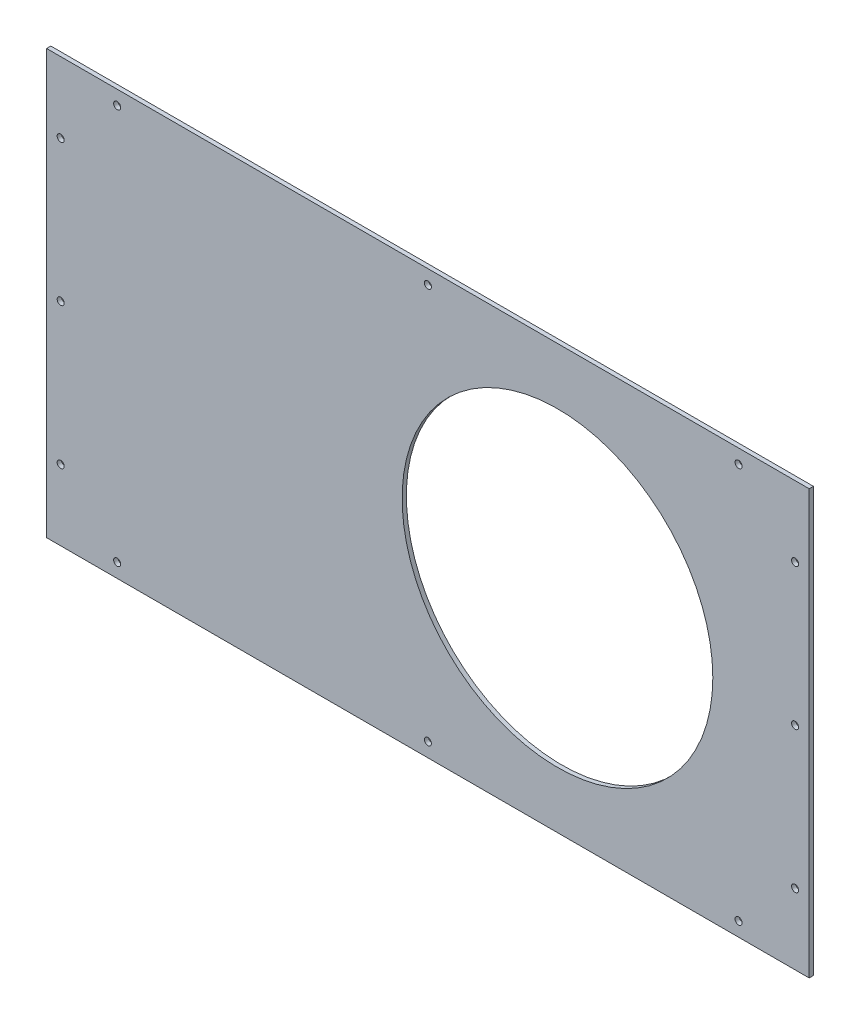
ISO-10303-21;
HEADER;
FILE_DESCRIPTION(('STEP AP214'),'2;1');
FILE_NAME('part.step','',(''),(''),'','','');
FILE_SCHEMA(('AUTOMOTIVE_DESIGN { 1 0 10303 214 1 1 1 1 }'));
ENDSEC;
DATA;
#1=APPLICATION_CONTEXT('core data for automotive mechanical design processes');
#2=APPLICATION_PROTOCOL_DEFINITION('international standard','automotive_design',2000,#1);
#3=PRODUCT_CONTEXT('',#1,'mechanical');
#4=PRODUCT('Part','Part','',(#3));
#5=PRODUCT_RELATED_PRODUCT_CATEGORY('part','',(#4));
#6=PRODUCT_DEFINITION_FORMATION('','',#4);
#7=PRODUCT_DEFINITION_CONTEXT('part definition',#1,'design');
#8=PRODUCT_DEFINITION('design','',#6,#7);
#9=PRODUCT_DEFINITION_SHAPE('','',#8);
#10=(LENGTH_UNIT() NAMED_UNIT(*) SI_UNIT(.MILLI.,.METRE.));
#11=(NAMED_UNIT(*) PLANE_ANGLE_UNIT() SI_UNIT($,.RADIAN.));
#12=(NAMED_UNIT(*) SI_UNIT($,.STERADIAN.) SOLID_ANGLE_UNIT());
#13=UNCERTAINTY_MEASURE_WITH_UNIT(LENGTH_MEASURE(1.E-05),#10,'distance_accuracy_value','');
#14=(GEOMETRIC_REPRESENTATION_CONTEXT(3) GLOBAL_UNCERTAINTY_ASSIGNED_CONTEXT((#13)) GLOBAL_UNIT_ASSIGNED_CONTEXT((#10,
#11,#12)) REPRESENTATION_CONTEXT('',''));
#15=CARTESIAN_POINT('',(0.,0.,0.));
#16=DIRECTION('',(0.,0.,1.));
#17=DIRECTION('',(1.,0.,0.));
#18=AXIS2_PLACEMENT_3D('',#15,#16,#17);
#19=CARTESIAN_POINT('',(270.,150.,3.));
#20=DIRECTION('',(-1.,0.,0.));
#21=DIRECTION('',(0.,0.,1.));
#22=AXIS2_PLACEMENT_3D('',#19,#20,#21);
#23=PLANE('',#22);
#24=DIRECTION('',(0.,1.,0.));
#25=VECTOR('',#24,1.);
#26=CARTESIAN_POINT('',(270.,150.,0.));
#27=LINE('',#26,#25);
#28=CARTESIAN_POINT('',(270.,-150.,0.));
#29=VERTEX_POINT('',#28);
#30=CARTESIAN_POINT('',(270.,150.,0.));
#31=VERTEX_POINT('',#30);
#32=EDGE_CURVE('E108',#29,#31,#27,.T.);
#33=ORIENTED_EDGE('',*,*,#32,.T.);
#34=DIRECTION('',(0.,0.,-1.));
#35=VECTOR('',#34,1.);
#36=CARTESIAN_POINT('',(270.,150.,3.));
#37=LINE('',#36,#35);
#38=CARTESIAN_POINT('',(270.,150.,3.));
#39=VERTEX_POINT('',#38);
#40=EDGE_CURVE('E11',#39,#31,#37,.T.);
#41=ORIENTED_EDGE('',*,*,#40,.F.);
#42=DIRECTION('',(0.,1.,0.));
#43=VECTOR('',#42,1.);
#44=CARTESIAN_POINT('',(270.,150.,3.));
#45=LINE('',#44,#43);
#46=CARTESIAN_POINT('',(270.,-150.,3.));
#47=VERTEX_POINT('',#46);
#48=EDGE_CURVE('E92',#47,#39,#45,.T.);
#49=ORIENTED_EDGE('',*,*,#48,.F.);
#50=DIRECTION('',(0.,0.,-1.));
#51=VECTOR('',#50,1.);
#52=CARTESIAN_POINT('',(270.,-150.,3.));
#53=LINE('',#52,#51);
#54=EDGE_CURVE('E104',#47,#29,#53,.T.);
#55=ORIENTED_EDGE('',*,*,#54,.T.);
#56=EDGE_LOOP('',(#33,#41,#49,#55));
#57=FACE_BOUND('',#56,.T.);
#58=ADVANCED_FACE('F40',(#57),#23,.F.);
#59=CARTESIAN_POINT('',(-270.,150.,3.));
#60=DIRECTION('',(0.,-1.,0.));
#61=DIRECTION('',(0.,0.,-1.));
#62=AXIS2_PLACEMENT_3D('',#59,#60,#61);
#63=PLANE('',#62);
#64=DIRECTION('',(-1.,0.,0.));
#65=VECTOR('',#64,1.);
#66=CARTESIAN_POINT('',(-270.,150.,0.));
#67=LINE('',#66,#65);
#68=CARTESIAN_POINT('',(-270.,150.,0.));
#69=VERTEX_POINT('',#68);
#70=EDGE_CURVE('E97',#31,#69,#67,.T.);
#71=ORIENTED_EDGE('',*,*,#70,.T.);
#72=DIRECTION('',(0.,0.,-1.));
#73=VECTOR('',#72,1.);
#74=CARTESIAN_POINT('',(-270.,150.,3.));
#75=LINE('',#74,#73);
#76=CARTESIAN_POINT('',(-270.,150.,3.));
#77=VERTEX_POINT('',#76);
#78=EDGE_CURVE('E49',#77,#69,#75,.T.);
#79=ORIENTED_EDGE('',*,*,#78,.F.);
#80=DIRECTION('',(-1.,0.,0.));
#81=VECTOR('',#80,1.);
#82=CARTESIAN_POINT('',(-270.,150.,3.));
#83=LINE('',#82,#81);
#84=EDGE_CURVE('E87',#39,#77,#83,.T.);
#85=ORIENTED_EDGE('',*,*,#84,.F.);
#86=ORIENTED_EDGE('',*,*,#40,.T.);
#87=EDGE_LOOP('',(#71,#79,#85,#86));
#88=FACE_BOUND('',#87,.T.);
#89=ADVANCED_FACE('F96',(#88),#63,.F.);
#90=CARTESIAN_POINT('',(-270.,150.,3.));
#91=DIRECTION('',(1.,0.,0.));
#92=DIRECTION('',(0.,1.,0.));
#93=AXIS2_PLACEMENT_3D('',#90,#91,#92);
#94=PLANE('',#93);
#95=DIRECTION('',(0.,-1.,0.));
#96=VECTOR('',#95,1.);
#97=CARTESIAN_POINT('',(-270.,150.,0.));
#98=LINE('',#97,#96);
#99=CARTESIAN_POINT('',(-270.,-150.,0.));
#100=VERTEX_POINT('',#99);
#101=EDGE_CURVE('E74',#69,#100,#98,.T.);
#102=ORIENTED_EDGE('',*,*,#101,.T.);
#103=DIRECTION('',(0.,0.,-1.));
#104=VECTOR('',#103,1.);
#105=CARTESIAN_POINT('',(-270.,-150.,3.));
#106=LINE('',#105,#104);
#107=CARTESIAN_POINT('',(-270.,-150.,3.));
#108=VERTEX_POINT('',#107);
#109=EDGE_CURVE('E99',#108,#100,#106,.T.);
#110=ORIENTED_EDGE('',*,*,#109,.F.);
#111=DIRECTION('',(0.,-1.,0.));
#112=VECTOR('',#111,1.);
#113=CARTESIAN_POINT('',(-270.,150.,3.));
#114=LINE('',#113,#112);
#115=EDGE_CURVE('E90',#77,#108,#114,.T.);
#116=ORIENTED_EDGE('',*,*,#115,.F.);
#117=ORIENTED_EDGE('',*,*,#78,.T.);
#118=EDGE_LOOP('',(#102,#110,#116,#117));
#119=FACE_BOUND('',#118,.T.);
#120=ADVANCED_FACE('F100',(#119),#94,.F.);
#121=CARTESIAN_POINT('',(-270.,-150.,3.));
#122=DIRECTION('',(0.,1.,0.));
#123=DIRECTION('',(0.,0.,1.));
#124=AXIS2_PLACEMENT_3D('',#121,#122,#123);
#125=PLANE('',#124);
#126=DIRECTION('',(1.,0.,0.));
#127=VECTOR('',#126,1.);
#128=CARTESIAN_POINT('',(-270.,-150.,0.));
#129=LINE('',#128,#127);
#130=EDGE_CURVE('E80',#100,#29,#129,.T.);
#131=ORIENTED_EDGE('',*,*,#130,.T.);
#132=ORIENTED_EDGE('',*,*,#54,.F.);
#133=DIRECTION('',(1.,0.,0.));
#134=VECTOR('',#133,1.);
#135=CARTESIAN_POINT('',(-270.,-150.,3.));
#136=LINE('',#135,#134);
#137=EDGE_CURVE('E57',#108,#47,#136,.T.);
#138=ORIENTED_EDGE('',*,*,#137,.F.);
#139=ORIENTED_EDGE('',*,*,#109,.T.);
#140=EDGE_LOOP('',(#131,#132,#138,#139));
#141=FACE_BOUND('',#140,.T.);
#142=ADVANCED_FACE('F122',(#141),#125,.F.);
#143=CARTESIAN_POINT('',(0.,0.,3.));
#144=DIRECTION('',(0.,0.,1.));
#145=DIRECTION('',(1.,0.,0.));
#146=AXIS2_PLACEMENT_3D('',#143,#144,#145);
#147=PLANE('',#146);
#148=CARTESIAN_POINT('',(91.7561908191329,0.,3.));
#149=DIRECTION('',(0.,0.,1.));
#150=DIRECTION('',(1.,0.,0.));
#151=AXIS2_PLACEMENT_3D('',#148,#149,#150);
#152=CIRCLE('',#151,110.);
#153=CARTESIAN_POINT('',(201.756190819133,0.,3.));
#154=VERTEX_POINT('',#153);
#155=EDGE_CURVE('E225',#154,#154,#152,.T.);
#156=ORIENTED_EDGE('',*,*,#155,.F.);
#157=EDGE_LOOP('',(#156));
#158=FACE_BOUND('',#157,.T.);
#159=CARTESIAN_POINT('',(-220.,-139.999999999999,3.));
#160=DIRECTION('',(0.,0.,1.));
#161=DIRECTION('',(-1.,0.,0.));
#162=AXIS2_PLACEMENT_3D('',#159,#160,#161);
#163=CIRCLE('',#162,2.5);
#164=CARTESIAN_POINT('',(-222.5,-139.999999999999,3.));
#165=VERTEX_POINT('',#164);
#166=EDGE_CURVE('E137',#165,#165,#163,.T.);
#167=ORIENTED_EDGE('',*,*,#166,.F.);
#168=EDGE_LOOP('',(#167));
#169=FACE_BOUND('',#168,.T.);
#170=CARTESIAN_POINT('',(0.,-140.,3.));
#171=DIRECTION('',(0.,0.,1.));
#172=DIRECTION('',(-1.,0.,0.));
#173=AXIS2_PLACEMENT_3D('',#170,#171,#172);
#174=CIRCLE('',#173,2.5);
#175=CARTESIAN_POINT('',(-2.5,-140.,3.));
#176=VERTEX_POINT('',#175);
#177=EDGE_CURVE('E146',#176,#176,#174,.T.);
#178=ORIENTED_EDGE('',*,*,#177,.F.);
#179=EDGE_LOOP('',(#178));
#180=FACE_BOUND('',#179,.T.);
#181=CARTESIAN_POINT('',(220.,-139.999999999999,3.));
#182=DIRECTION('',(0.,0.,1.));
#183=DIRECTION('',(1.,0.,0.));
#184=AXIS2_PLACEMENT_3D('',#181,#182,#183);
#185=CIRCLE('',#184,2.5);
#186=CARTESIAN_POINT('',(222.5,-139.999999999999,3.));
#187=VERTEX_POINT('',#186);
#188=EDGE_CURVE('E154',#187,#187,#185,.T.);
#189=ORIENTED_EDGE('',*,*,#188,.F.);
#190=EDGE_LOOP('',(#189));
#191=FACE_BOUND('',#190,.T.);
#192=CARTESIAN_POINT('',(220.,139.999999999999,3.));
#193=DIRECTION('',(0.,0.,1.));
#194=DIRECTION('',(-1.,0.,0.));
#195=AXIS2_PLACEMENT_3D('',#192,#193,#194);
#196=CIRCLE('',#195,2.5);
#197=CARTESIAN_POINT('',(217.5,139.999999999999,3.));
#198=VERTEX_POINT('',#197);
#199=EDGE_CURVE('E172',#198,#198,#196,.T.);
#200=ORIENTED_EDGE('',*,*,#199,.F.);
#201=EDGE_LOOP('',(#200));
#202=FACE_BOUND('',#201,.T.);
#203=CARTESIAN_POINT('',(260.,-100.,3.));
#204=DIRECTION('',(0.,0.,1.));
#205=DIRECTION('',(1.,0.,0.));
#206=AXIS2_PLACEMENT_3D('',#203,#204,#205);
#207=CIRCLE('',#206,2.50000000000002);
#208=CARTESIAN_POINT('',(262.5,-100.,3.));
#209=VERTEX_POINT('',#208);
#210=EDGE_CURVE('E163',#209,#209,#207,.T.);
#211=ORIENTED_EDGE('',*,*,#210,.F.);
#212=EDGE_LOOP('',(#211));
#213=FACE_BOUND('',#212,.T.);
#214=CARTESIAN_POINT('',(260.,0.,3.));
#215=DIRECTION('',(0.,0.,1.));
#216=DIRECTION('',(-1.,0.,0.));
#217=AXIS2_PLACEMENT_3D('',#214,#215,#216);
#218=CIRCLE('',#217,2.50000000000008);
#219=CARTESIAN_POINT('',(257.5,0.,3.));
#220=VERTEX_POINT('',#219);
#221=EDGE_CURVE('E188',#220,#220,#218,.T.);
#222=ORIENTED_EDGE('',*,*,#221,.F.);
#223=EDGE_LOOP('',(#222));
#224=FACE_BOUND('',#223,.T.);
#225=CARTESIAN_POINT('',(260.,100.,3.));
#226=DIRECTION('',(0.,0.,1.));
#227=DIRECTION('',(-1.,0.,0.));
#228=AXIS2_PLACEMENT_3D('',#225,#226,#227);
#229=CIRCLE('',#228,2.50000000000002);
#230=CARTESIAN_POINT('',(257.5,100.,3.));
#231=VERTEX_POINT('',#230);
#232=EDGE_CURVE('E162',#231,#231,#229,.T.);
#233=ORIENTED_EDGE('',*,*,#232,.F.);
#234=EDGE_LOOP('',(#233));
#235=FACE_BOUND('',#234,.T.);
#236=CARTESIAN_POINT('',(-260.,0.,3.));
#237=DIRECTION('',(0.,0.,1.));
#238=DIRECTION('',(1.,0.,0.));
#239=AXIS2_PLACEMENT_3D('',#236,#237,#238);
#240=CIRCLE('',#239,2.50000000000002);
#241=CARTESIAN_POINT('',(-257.5,0.,3.));
#242=VERTEX_POINT('',#241);
#243=EDGE_CURVE('E204',#242,#242,#240,.T.);
#244=ORIENTED_EDGE('',*,*,#243,.F.);
#245=EDGE_LOOP('',(#244));
#246=FACE_BOUND('',#245,.T.);
#247=CARTESIAN_POINT('',(-220.,139.999999999999,3.));
#248=DIRECTION('',(0.,0.,1.));
#249=DIRECTION('',(1.,0.,0.));
#250=AXIS2_PLACEMENT_3D('',#247,#248,#249);
#251=CIRCLE('',#250,2.5);
#252=CARTESIAN_POINT('',(-217.5,139.999999999999,3.));
#253=VERTEX_POINT('',#252);
#254=EDGE_CURVE('E195',#253,#253,#251,.T.);
#255=ORIENTED_EDGE('',*,*,#254,.F.);
#256=EDGE_LOOP('',(#255));
#257=FACE_BOUND('',#256,.T.);
#258=CARTESIAN_POINT('',(-260.,-100.,3.));
#259=DIRECTION('',(0.,0.,1.));
#260=DIRECTION('',(-1.,0.,0.));
#261=AXIS2_PLACEMENT_3D('',#258,#259,#260);
#262=CIRCLE('',#261,2.50000000000002);
#263=CARTESIAN_POINT('',(-262.5,-100.,3.));
#264=VERTEX_POINT('',#263);
#265=EDGE_CURVE('E218',#264,#264,#262,.T.);
#266=ORIENTED_EDGE('',*,*,#265,.F.);
#267=EDGE_LOOP('',(#266));
#268=FACE_BOUND('',#267,.T.);
#269=CARTESIAN_POINT('',(-260.,100.,3.));
#270=DIRECTION('',(0.,0.,1.));
#271=DIRECTION('',(1.,0.,0.));
#272=AXIS2_PLACEMENT_3D('',#269,#270,#271);
#273=CIRCLE('',#272,2.50000000000002);
#274=CARTESIAN_POINT('',(-257.5,100.,3.));
#275=VERTEX_POINT('',#274);
#276=EDGE_CURVE('E180',#275,#275,#273,.T.);
#277=ORIENTED_EDGE('',*,*,#276,.F.);
#278=EDGE_LOOP('',(#277));
#279=FACE_BOUND('',#278,.T.);
#280=CARTESIAN_POINT('',(0.,140.,3.));
#281=DIRECTION('',(0.,0.,1.));
#282=DIRECTION('',(1.,0.,0.));
#283=AXIS2_PLACEMENT_3D('',#280,#281,#282);
#284=CIRCLE('',#283,2.5);
#285=CARTESIAN_POINT('',(2.5,140.,3.));
#286=VERTEX_POINT('',#285);
#287=EDGE_CURVE('E129',#286,#286,#284,.T.);
#288=ORIENTED_EDGE('',*,*,#287,.F.);
#289=EDGE_LOOP('',(#288));
#290=FACE_BOUND('',#289,.T.);
#291=ORIENTED_EDGE('',*,*,#48,.T.);
#292=ORIENTED_EDGE('',*,*,#84,.T.);
#293=ORIENTED_EDGE('',*,*,#115,.T.);
#294=ORIENTED_EDGE('',*,*,#137,.T.);
#295=EDGE_LOOP('',(#291,#292,#293,#294));
#296=FACE_BOUND('',#295,.T.);
#297=ADVANCED_FACE('F88',(#158,#169,#180,#191,#202,#213,#224,#235,#246,#257,#268,#279,#290,
#296),#147,.T.);
#298=CARTESIAN_POINT('',(0.,0.,0.));
#299=DIRECTION('',(0.,0.,1.));
#300=DIRECTION('',(1.,0.,0.));
#301=AXIS2_PLACEMENT_3D('',#298,#299,#300);
#302=PLANE('',#301);
#303=CARTESIAN_POINT('',(91.7561908191329,0.,0.));
#304=DIRECTION('',(0.,0.,1.));
#305=DIRECTION('',(1.,0.,0.));
#306=AXIS2_PLACEMENT_3D('',#303,#304,#305);
#307=CIRCLE('',#306,110.);
#308=CARTESIAN_POINT('',(201.756190819133,0.,0.));
#309=VERTEX_POINT('',#308);
#310=EDGE_CURVE('E142',#309,#309,#307,.T.);
#311=ORIENTED_EDGE('',*,*,#310,.T.);
#312=EDGE_LOOP('',(#311));
#313=FACE_BOUND('',#312,.T.);
#314=CARTESIAN_POINT('',(-220.,-139.999999999999,0.));
#315=DIRECTION('',(0.,0.,1.));
#316=DIRECTION('',(-1.,0.,0.));
#317=AXIS2_PLACEMENT_3D('',#314,#315,#316);
#318=CIRCLE('',#317,2.5);
#319=CARTESIAN_POINT('',(-222.5,-139.999999999999,0.));
#320=VERTEX_POINT('',#319);
#321=EDGE_CURVE('E141',#320,#320,#318,.T.);
#322=ORIENTED_EDGE('',*,*,#321,.T.);
#323=EDGE_LOOP('',(#322));
#324=FACE_BOUND('',#323,.T.);
#325=CARTESIAN_POINT('',(0.,-140.,0.));
#326=DIRECTION('',(0.,0.,1.));
#327=DIRECTION('',(-1.,0.,0.));
#328=AXIS2_PLACEMENT_3D('',#325,#326,#327);
#329=CIRCLE('',#328,2.5);
#330=CARTESIAN_POINT('',(-2.5,-140.,0.));
#331=VERTEX_POINT('',#330);
#332=EDGE_CURVE('E150',#331,#331,#329,.T.);
#333=ORIENTED_EDGE('',*,*,#332,.T.);
#334=EDGE_LOOP('',(#333));
#335=FACE_BOUND('',#334,.T.);
#336=CARTESIAN_POINT('',(220.,-139.999999999999,0.));
#337=DIRECTION('',(0.,0.,1.));
#338=DIRECTION('',(1.,0.,0.));
#339=AXIS2_PLACEMENT_3D('',#336,#337,#338);
#340=CIRCLE('',#339,2.5);
#341=CARTESIAN_POINT('',(222.5,-139.999999999999,0.));
#342=VERTEX_POINT('',#341);
#343=EDGE_CURVE('E158',#342,#342,#340,.T.);
#344=ORIENTED_EDGE('',*,*,#343,.T.);
#345=EDGE_LOOP('',(#344));
#346=FACE_BOUND('',#345,.T.);
#347=CARTESIAN_POINT('',(220.,139.999999999999,0.));
#348=DIRECTION('',(0.,0.,1.));
#349=DIRECTION('',(-1.,0.,0.));
#350=AXIS2_PLACEMENT_3D('',#347,#348,#349);
#351=CIRCLE('',#350,2.5);
#352=CARTESIAN_POINT('',(217.5,139.999999999999,0.));
#353=VERTEX_POINT('',#352);
#354=EDGE_CURVE('E176',#353,#353,#351,.T.);
#355=ORIENTED_EDGE('',*,*,#354,.T.);
#356=EDGE_LOOP('',(#355));
#357=FACE_BOUND('',#356,.T.);
#358=CARTESIAN_POINT('',(260.,-100.,0.));
#359=DIRECTION('',(0.,0.,1.));
#360=DIRECTION('',(1.,0.,0.));
#361=AXIS2_PLACEMENT_3D('',#358,#359,#360);
#362=CIRCLE('',#361,2.50000000000002);
#363=CARTESIAN_POINT('',(262.5,-100.,0.));
#364=VERTEX_POINT('',#363);
#365=EDGE_CURVE('E167',#364,#364,#362,.T.);
#366=ORIENTED_EDGE('',*,*,#365,.T.);
#367=EDGE_LOOP('',(#366));
#368=FACE_BOUND('',#367,.T.);
#369=CARTESIAN_POINT('',(260.,0.,0.));
#370=DIRECTION('',(0.,0.,1.));
#371=DIRECTION('',(-1.,0.,0.));
#372=AXIS2_PLACEMENT_3D('',#369,#370,#371);
#373=CIRCLE('',#372,2.50000000000008);
#374=CARTESIAN_POINT('',(257.5,0.,0.));
#375=VERTEX_POINT('',#374);
#376=EDGE_CURVE('E168',#375,#375,#373,.T.);
#377=ORIENTED_EDGE('',*,*,#376,.T.);
#378=EDGE_LOOP('',(#377));
#379=FACE_BOUND('',#378,.T.);
#380=CARTESIAN_POINT('',(260.,100.,0.));
#381=DIRECTION('',(0.,0.,1.));
#382=DIRECTION('',(-1.,0.,0.));
#383=AXIS2_PLACEMENT_3D('',#380,#381,#382);
#384=CIRCLE('',#383,2.50000000000002);
#385=CARTESIAN_POINT('',(257.5,100.,0.));
#386=VERTEX_POINT('',#385);
#387=EDGE_CURVE('E184',#386,#386,#384,.T.);
#388=ORIENTED_EDGE('',*,*,#387,.T.);
#389=EDGE_LOOP('',(#388));
#390=FACE_BOUND('',#389,.T.);
#391=CARTESIAN_POINT('',(-260.,0.,0.));
#392=DIRECTION('',(0.,0.,1.));
#393=DIRECTION('',(1.,0.,0.));
#394=AXIS2_PLACEMENT_3D('',#391,#392,#393);
#395=CIRCLE('',#394,2.50000000000002);
#396=CARTESIAN_POINT('',(-257.5,0.,0.));
#397=VERTEX_POINT('',#396);
#398=EDGE_CURVE('E133',#397,#397,#395,.T.);
#399=ORIENTED_EDGE('',*,*,#398,.T.);
#400=EDGE_LOOP('',(#399));
#401=FACE_BOUND('',#400,.T.);
#402=CARTESIAN_POINT('',(-220.,139.999999999999,0.));
#403=DIRECTION('',(0.,0.,1.));
#404=DIRECTION('',(1.,0.,0.));
#405=AXIS2_PLACEMENT_3D('',#402,#403,#404);
#406=CIRCLE('',#405,2.5);
#407=CARTESIAN_POINT('',(-217.5,139.999999999999,0.));
#408=VERTEX_POINT('',#407);
#409=EDGE_CURVE('E199',#408,#408,#406,.T.);
#410=ORIENTED_EDGE('',*,*,#409,.T.);
#411=EDGE_LOOP('',(#410));
#412=FACE_BOUND('',#411,.T.);
#413=CARTESIAN_POINT('',(-260.,-100.,0.));
#414=DIRECTION('',(0.,0.,1.));
#415=DIRECTION('',(-1.,0.,0.));
#416=AXIS2_PLACEMENT_3D('',#413,#414,#415);
#417=CIRCLE('',#416,2.50000000000002);
#418=CARTESIAN_POINT('',(-262.5,-100.,0.));
#419=VERTEX_POINT('',#418);
#420=EDGE_CURVE('E200',#419,#419,#417,.T.);
#421=ORIENTED_EDGE('',*,*,#420,.T.);
#422=EDGE_LOOP('',(#421));
#423=FACE_BOUND('',#422,.T.);
#424=CARTESIAN_POINT('',(-260.,100.,0.));
#425=DIRECTION('',(0.,0.,1.));
#426=DIRECTION('',(1.,0.,0.));
#427=AXIS2_PLACEMENT_3D('',#424,#425,#426);
#428=CIRCLE('',#427,2.50000000000002);
#429=CARTESIAN_POINT('',(-257.5,100.,0.));
#430=VERTEX_POINT('',#429);
#431=EDGE_CURVE('E214',#430,#430,#428,.T.);
#432=ORIENTED_EDGE('',*,*,#431,.T.);
#433=EDGE_LOOP('',(#432));
#434=FACE_BOUND('',#433,.T.);
#435=CARTESIAN_POINT('',(0.,140.,0.));
#436=DIRECTION('',(0.,0.,1.));
#437=DIRECTION('',(1.,0.,0.));
#438=AXIS2_PLACEMENT_3D('',#435,#436,#437);
#439=CIRCLE('',#438,2.5);
#440=CARTESIAN_POINT('',(2.5,140.,0.));
#441=VERTEX_POINT('',#440);
#442=EDGE_CURVE('E112',#441,#441,#439,.T.);
#443=ORIENTED_EDGE('',*,*,#442,.T.);
#444=EDGE_LOOP('',(#443));
#445=FACE_BOUND('',#444,.T.);
#446=ORIENTED_EDGE('',*,*,#32,.F.);
#447=ORIENTED_EDGE('',*,*,#130,.F.);
#448=ORIENTED_EDGE('',*,*,#101,.F.);
#449=ORIENTED_EDGE('',*,*,#70,.F.);
#450=EDGE_LOOP('',(#446,#447,#448,#449));
#451=FACE_BOUND('',#450,.T.);
#452=ADVANCED_FACE('F125',(#313,#324,#335,#346,#357,#368,#379,#390,#401,#412,#423,#434,#445,
#451),#302,.F.);
#453=CARTESIAN_POINT('',(0.,140.,0.));
#454=DIRECTION('',(0.,0.,1.));
#455=DIRECTION('',(1.,0.,0.));
#456=AXIS2_PLACEMENT_3D('',#453,#454,#455);
#457=CYLINDRICAL_SURFACE('',#456,2.5);
#458=ORIENTED_EDGE('',*,*,#442,.F.);
#459=EDGE_LOOP('',(#458));
#460=FACE_BOUND('',#459,.T.);
#461=ORIENTED_EDGE('',*,*,#287,.T.);
#462=EDGE_LOOP('',(#461));
#463=FACE_BOUND('',#462,.T.);
#464=ADVANCED_FACE('F269',(#460,#463),#457,.F.);
#465=CARTESIAN_POINT('',(-260.,100.,0.));
#466=DIRECTION('',(0.,0.,1.));
#467=DIRECTION('',(1.,0.,0.));
#468=AXIS2_PLACEMENT_3D('',#465,#466,#467);
#469=CYLINDRICAL_SURFACE('',#468,2.50000000000002);
#470=ORIENTED_EDGE('',*,*,#431,.F.);
#471=EDGE_LOOP('',(#470));
#472=FACE_BOUND('',#471,.T.);
#473=ORIENTED_EDGE('',*,*,#276,.T.);
#474=EDGE_LOOP('',(#473));
#475=FACE_BOUND('',#474,.T.);
#476=ADVANCED_FACE('F271',(#472,#475),#469,.F.);
#477=CARTESIAN_POINT('',(-260.,-100.,0.));
#478=DIRECTION('',(0.,0.,1.));
#479=DIRECTION('',(1.,0.,0.));
#480=AXIS2_PLACEMENT_3D('',#477,#478,#479);
#481=CYLINDRICAL_SURFACE('',#480,2.50000000000002);
#482=ORIENTED_EDGE('',*,*,#420,.F.);
#483=EDGE_LOOP('',(#482));
#484=FACE_BOUND('',#483,.T.);
#485=ORIENTED_EDGE('',*,*,#265,.T.);
#486=EDGE_LOOP('',(#485));
#487=FACE_BOUND('',#486,.T.);
#488=ADVANCED_FACE('F278',(#484,#487),#481,.F.);
#489=CARTESIAN_POINT('',(-220.,139.999999999999,0.));
#490=DIRECTION('',(0.,0.,1.));
#491=DIRECTION('',(1.,0.,0.));
#492=AXIS2_PLACEMENT_3D('',#489,#490,#491);
#493=CYLINDRICAL_SURFACE('',#492,2.5);
#494=ORIENTED_EDGE('',*,*,#409,.F.);
#495=EDGE_LOOP('',(#494));
#496=FACE_BOUND('',#495,.T.);
#497=ORIENTED_EDGE('',*,*,#254,.T.);
#498=EDGE_LOOP('',(#497));
#499=FACE_BOUND('',#498,.T.);
#500=ADVANCED_FACE('F376',(#496,#499),#493,.F.);
#501=CARTESIAN_POINT('',(-260.,0.,0.));
#502=DIRECTION('',(0.,0.,1.));
#503=DIRECTION('',(1.,0.,0.));
#504=AXIS2_PLACEMENT_3D('',#501,#502,#503);
#505=CYLINDRICAL_SURFACE('',#504,2.50000000000002);
#506=ORIENTED_EDGE('',*,*,#398,.F.);
#507=EDGE_LOOP('',(#506));
#508=FACE_BOUND('',#507,.T.);
#509=ORIENTED_EDGE('',*,*,#243,.T.);
#510=EDGE_LOOP('',(#509));
#511=FACE_BOUND('',#510,.T.);
#512=ADVANCED_FACE('F368',(#508,#511),#505,.F.);
#513=CARTESIAN_POINT('',(260.,100.,0.));
#514=DIRECTION('',(0.,0.,1.));
#515=DIRECTION('',(1.,0.,0.));
#516=AXIS2_PLACEMENT_3D('',#513,#514,#515);
#517=CYLINDRICAL_SURFACE('',#516,2.50000000000002);
#518=ORIENTED_EDGE('',*,*,#387,.F.);
#519=EDGE_LOOP('',(#518));
#520=FACE_BOUND('',#519,.T.);
#521=ORIENTED_EDGE('',*,*,#232,.T.);
#522=EDGE_LOOP('',(#521));
#523=FACE_BOUND('',#522,.T.);
#524=ADVANCED_FACE('F360',(#520,#523),#517,.F.);
#525=CARTESIAN_POINT('',(260.,0.,0.));
#526=DIRECTION('',(0.,0.,1.));
#527=DIRECTION('',(1.,0.,0.));
#528=AXIS2_PLACEMENT_3D('',#525,#526,#527);
#529=CYLINDRICAL_SURFACE('',#528,2.50000000000008);
#530=ORIENTED_EDGE('',*,*,#376,.F.);
#531=EDGE_LOOP('',(#530));
#532=FACE_BOUND('',#531,.T.);
#533=ORIENTED_EDGE('',*,*,#221,.T.);
#534=EDGE_LOOP('',(#533));
#535=FACE_BOUND('',#534,.T.);
#536=ADVANCED_FACE('F352',(#532,#535),#529,.F.);
#537=CARTESIAN_POINT('',(260.,-100.,0.));
#538=DIRECTION('',(0.,0.,1.));
#539=DIRECTION('',(1.,0.,0.));
#540=AXIS2_PLACEMENT_3D('',#537,#538,#539);
#541=CYLINDRICAL_SURFACE('',#540,2.50000000000002);
#542=ORIENTED_EDGE('',*,*,#365,.F.);
#543=EDGE_LOOP('',(#542));
#544=FACE_BOUND('',#543,.T.);
#545=ORIENTED_EDGE('',*,*,#210,.T.);
#546=EDGE_LOOP('',(#545));
#547=FACE_BOUND('',#546,.T.);
#548=ADVANCED_FACE('F344',(#544,#547),#541,.F.);
#549=CARTESIAN_POINT('',(220.,139.999999999999,0.));
#550=DIRECTION('',(0.,0.,1.));
#551=DIRECTION('',(1.,0.,0.));
#552=AXIS2_PLACEMENT_3D('',#549,#550,#551);
#553=CYLINDRICAL_SURFACE('',#552,2.5);
#554=ORIENTED_EDGE('',*,*,#354,.F.);
#555=EDGE_LOOP('',(#554));
#556=FACE_BOUND('',#555,.T.);
#557=ORIENTED_EDGE('',*,*,#199,.T.);
#558=EDGE_LOOP('',(#557));
#559=FACE_BOUND('',#558,.T.);
#560=ADVANCED_FACE('F336',(#556,#559),#553,.F.);
#561=CARTESIAN_POINT('',(220.,-139.999999999999,0.));
#562=DIRECTION('',(0.,0.,1.));
#563=DIRECTION('',(1.,0.,0.));
#564=AXIS2_PLACEMENT_3D('',#561,#562,#563);
#565=CYLINDRICAL_SURFACE('',#564,2.5);
#566=ORIENTED_EDGE('',*,*,#343,.F.);
#567=EDGE_LOOP('',(#566));
#568=FACE_BOUND('',#567,.T.);
#569=ORIENTED_EDGE('',*,*,#188,.T.);
#570=EDGE_LOOP('',(#569));
#571=FACE_BOUND('',#570,.T.);
#572=ADVANCED_FACE('F328',(#568,#571),#565,.F.);
#573=CARTESIAN_POINT('',(0.,-140.,0.));
#574=DIRECTION('',(0.,0.,1.));
#575=DIRECTION('',(1.,0.,0.));
#576=AXIS2_PLACEMENT_3D('',#573,#574,#575);
#577=CYLINDRICAL_SURFACE('',#576,2.5);
#578=ORIENTED_EDGE('',*,*,#332,.F.);
#579=EDGE_LOOP('',(#578));
#580=FACE_BOUND('',#579,.T.);
#581=ORIENTED_EDGE('',*,*,#177,.T.);
#582=EDGE_LOOP('',(#581));
#583=FACE_BOUND('',#582,.T.);
#584=ADVANCED_FACE('F322',(#580,#583),#577,.F.);
#585=CARTESIAN_POINT('',(-220.,-139.999999999999,0.));
#586=DIRECTION('',(0.,0.,1.));
#587=DIRECTION('',(1.,0.,0.));
#588=AXIS2_PLACEMENT_3D('',#585,#586,#587);
#589=CYLINDRICAL_SURFACE('',#588,2.5);
#590=ORIENTED_EDGE('',*,*,#321,.F.);
#591=EDGE_LOOP('',(#590));
#592=FACE_BOUND('',#591,.T.);
#593=ORIENTED_EDGE('',*,*,#166,.T.);
#594=EDGE_LOOP('',(#593));
#595=FACE_BOUND('',#594,.T.);
#596=ADVANCED_FACE('F238',(#592,#595),#589,.F.);
#597=CARTESIAN_POINT('',(91.7561908191329,0.,0.));
#598=DIRECTION('',(0.,0.,1.));
#599=DIRECTION('',(1.,0.,0.));
#600=AXIS2_PLACEMENT_3D('',#597,#598,#599);
#601=CYLINDRICAL_SURFACE('',#600,110.);
#602=ORIENTED_EDGE('',*,*,#310,.F.);
#603=EDGE_LOOP('',(#602));
#604=FACE_BOUND('',#603,.T.);
#605=ORIENTED_EDGE('',*,*,#155,.T.);
#606=EDGE_LOOP('',(#605));
#607=FACE_BOUND('',#606,.T.);
#608=ADVANCED_FACE('F235',(#604,#607),#601,.F.);
#609=CLOSED_SHELL('',(#58,#89,#120,#142,#297,#452,#464,#476,#488,#500,#512,#524,#536,#548,#560,
#572,#584,#596,#608));
#610=MANIFOLD_SOLID_BREP('B2',#609);
#611=ADVANCED_BREP_SHAPE_REPRESENTATION('',(#18,#610),#14);
#612=SHAPE_DEFINITION_REPRESENTATION(#9,#611);
ENDSEC;
END-ISO-10303-21;
